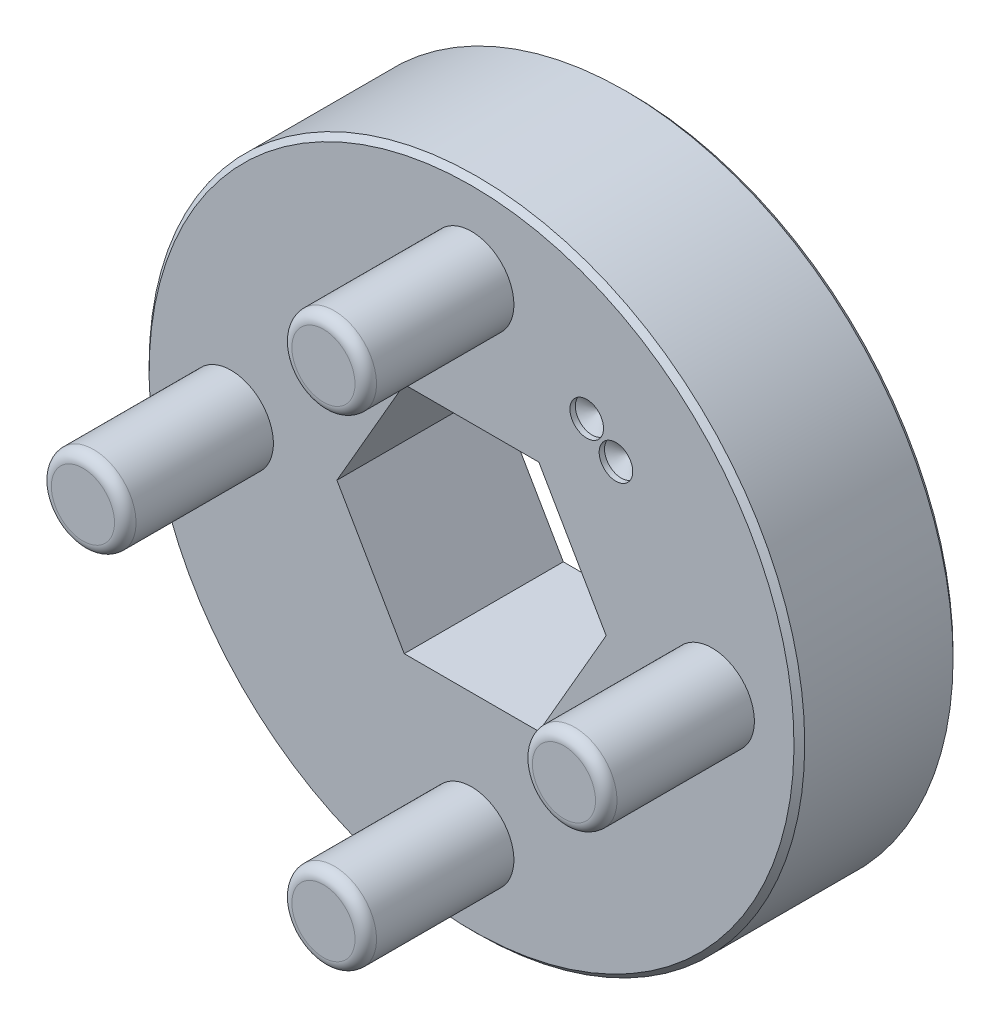
ISO-10303-21;
HEADER;
FILE_DESCRIPTION(('STEP AP214'),'2;1');
FILE_NAME('part.step','',(''),(''),'','','');
FILE_SCHEMA(('AUTOMOTIVE_DESIGN { 1 0 10303 214 1 1 1 1 }'));
ENDSEC;
DATA;
#1=APPLICATION_CONTEXT('core data for automotive mechanical design processes');
#2=APPLICATION_PROTOCOL_DEFINITION('international standard','automotive_design',2000,#1);
#3=PRODUCT_CONTEXT('',#1,'mechanical');
#4=PRODUCT('Part','Part','',(#3));
#5=PRODUCT_RELATED_PRODUCT_CATEGORY('part','',(#4));
#6=PRODUCT_DEFINITION_FORMATION('','',#4);
#7=PRODUCT_DEFINITION_CONTEXT('part definition',#1,'design');
#8=PRODUCT_DEFINITION('design','',#6,#7);
#9=PRODUCT_DEFINITION_SHAPE('','',#8);
#10=(LENGTH_UNIT() NAMED_UNIT(*) SI_UNIT(.MILLI.,.METRE.));
#11=(NAMED_UNIT(*) PLANE_ANGLE_UNIT() SI_UNIT($,.RADIAN.));
#12=(NAMED_UNIT(*) SI_UNIT($,.STERADIAN.) SOLID_ANGLE_UNIT());
#13=UNCERTAINTY_MEASURE_WITH_UNIT(LENGTH_MEASURE(1.E-05),#10,'distance_accuracy_value','');
#14=(GEOMETRIC_REPRESENTATION_CONTEXT(3) GLOBAL_UNCERTAINTY_ASSIGNED_CONTEXT((#13)) GLOBAL_UNIT_ASSIGNED_CONTEXT((#10,
#11,#12)) REPRESENTATION_CONTEXT('',''));
#15=CARTESIAN_POINT('',(0.,0.,0.));
#16=DIRECTION('',(0.,0.,1.));
#17=DIRECTION('',(1.,0.,0.));
#18=AXIS2_PLACEMENT_3D('',#15,#16,#17);
#19=CARTESIAN_POINT('',(-11.3665,1.19057767913881E-13,14.5184));
#20=DIRECTION('',(0.,0.,1.));
#21=DIRECTION('',(1.,0.,0.));
#22=AXIS2_PLACEMENT_3D('',#19,#20,#21);
#23=PLANE('',#22);
#24=CARTESIAN_POINT('',(-11.3665,1.19057767913881E-13,14.5184));
#25=DIRECTION('',(0.,0.,-1.));
#26=DIRECTION('',(-1.,0.,0.));
#27=AXIS2_PLACEMENT_3D('',#24,#25,#26);
#28=CIRCLE('',#27,1.492);
#29=CARTESIAN_POINT('',(-12.8585,1.19252927627794E-13,14.5184));
#30=VERTEX_POINT('',#29);
#31=CARTESIAN_POINT('',(-9.8745,1.19057767913881E-13,14.5184));
#32=VERTEX_POINT('',#31);
#33=EDGE_CURVE('E216',#30,#32,#28,.T.);
#34=ORIENTED_EDGE('',*,*,#33,.F.);
#35=CARTESIAN_POINT('',(-11.3665,1.19057767913881E-13,14.5184));
#36=DIRECTION('',(0.,0.,-1.));
#37=DIRECTION('',(1.,0.,0.));
#38=AXIS2_PLACEMENT_3D('',#35,#36,#37);
#39=CIRCLE('',#38,1.492);
#40=EDGE_CURVE('E213',#32,#30,#39,.T.);
#41=ORIENTED_EDGE('',*,*,#40,.F.);
#42=EDGE_LOOP('',(#34,#41));
#43=FACE_BOUND('',#42,.T.);
#44=ADVANCED_FACE('F17',(#43),#23,.T.);
#45=CARTESIAN_POINT('',(0.,-11.3665,14.5184));
#46=DIRECTION('',(0.,0.,1.));
#47=DIRECTION('',(1.,0.,0.));
#48=AXIS2_PLACEMENT_3D('',#45,#46,#47);
#49=PLANE('',#48);
#50=CARTESIAN_POINT('',(0.,-11.3665,14.5184));
#51=DIRECTION('',(0.,0.,-1.));
#52=DIRECTION('',(-1.,0.,0.));
#53=AXIS2_PLACEMENT_3D('',#50,#51,#52);
#54=CIRCLE('',#53,1.492);
#55=CARTESIAN_POINT('',(-1.492,-11.3665,14.5184));
#56=VERTEX_POINT('',#55);
#57=CARTESIAN_POINT('',(1.492,-11.3665,14.5184));
#58=VERTEX_POINT('',#57);
#59=EDGE_CURVE('E292',#56,#58,#54,.T.);
#60=ORIENTED_EDGE('',*,*,#59,.F.);
#61=CARTESIAN_POINT('',(0.,-11.3665,14.5184));
#62=DIRECTION('',(0.,0.,-1.));
#63=DIRECTION('',(1.,0.,0.));
#64=AXIS2_PLACEMENT_3D('',#61,#62,#63);
#65=CIRCLE('',#64,1.492);
#66=EDGE_CURVE('E220',#58,#56,#65,.T.);
#67=ORIENTED_EDGE('',*,*,#66,.F.);
#68=EDGE_LOOP('',(#60,#67));
#69=FACE_BOUND('',#68,.T.);
#70=ADVANCED_FACE('F294',(#69),#49,.T.);
#71=CARTESIAN_POINT('',(11.3665,0.,14.5184));
#72=DIRECTION('',(0.,0.,1.));
#73=DIRECTION('',(1.,0.,0.));
#74=AXIS2_PLACEMENT_3D('',#71,#72,#73);
#75=PLANE('',#74);
#76=CARTESIAN_POINT('',(11.3665,0.,14.5184));
#77=DIRECTION('',(0.,0.,-1.));
#78=DIRECTION('',(-1.,0.,0.));
#79=AXIS2_PLACEMENT_3D('',#76,#77,#78);
#80=CIRCLE('',#79,1.492);
#81=CARTESIAN_POINT('',(9.8745,0.,14.5184));
#82=VERTEX_POINT('',#81);
#83=CARTESIAN_POINT('',(12.8585,0.,14.5184));
#84=VERTEX_POINT('',#83);
#85=EDGE_CURVE('E288',#82,#84,#80,.T.);
#86=ORIENTED_EDGE('',*,*,#85,.F.);
#87=CARTESIAN_POINT('',(11.3665,0.,14.5184));
#88=DIRECTION('',(0.,0.,-1.));
#89=DIRECTION('',(1.,0.,0.));
#90=AXIS2_PLACEMENT_3D('',#87,#88,#89);
#91=CIRCLE('',#90,1.492);
#92=EDGE_CURVE('E279',#84,#82,#91,.T.);
#93=ORIENTED_EDGE('',*,*,#92,.F.);
#94=EDGE_LOOP('',(#86,#93));
#95=FACE_BOUND('',#94,.T.);
#96=ADVANCED_FACE('F137',(#95),#75,.T.);
#97=CARTESIAN_POINT('',(0.,11.3665,14.5184));
#98=DIRECTION('',(0.,0.,1.));
#99=DIRECTION('',(1.,0.,0.));
#100=AXIS2_PLACEMENT_3D('',#97,#98,#99);
#101=PLANE('',#100);
#102=CARTESIAN_POINT('',(0.,11.3665,14.5184));
#103=DIRECTION('',(0.,0.,-1.));
#104=DIRECTION('',(-1.,0.,0.));
#105=AXIS2_PLACEMENT_3D('',#102,#103,#104);
#106=CIRCLE('',#105,1.492);
#107=CARTESIAN_POINT('',(-1.492,11.3665,14.5184));
#108=VERTEX_POINT('',#107);
#109=CARTESIAN_POINT('',(1.492,11.3665,14.5184));
#110=VERTEX_POINT('',#109);
#111=EDGE_CURVE('E112',#108,#110,#106,.T.);
#112=ORIENTED_EDGE('',*,*,#111,.F.);
#113=CARTESIAN_POINT('',(0.,11.3665,14.5184));
#114=DIRECTION('',(0.,0.,-1.));
#115=DIRECTION('',(1.,0.,0.));
#116=AXIS2_PLACEMENT_3D('',#113,#114,#115);
#117=CIRCLE('',#116,1.492);
#118=EDGE_CURVE('E117',#110,#108,#117,.T.);
#119=ORIENTED_EDGE('',*,*,#118,.F.);
#120=EDGE_LOOP('',(#112,#119));
#121=FACE_BOUND('',#120,.T.);
#122=ADVANCED_FACE('F105',(#121),#101,.T.);
#123=CARTESIAN_POINT('',(5.44497650823394,8.41824079302751,7.26439999999684));
#124=DIRECTION('',(0.,0.,1.));
#125=DIRECTION('',(0.,-1.,0.));
#126=AXIS2_PLACEMENT_3D('',#123,#124,#125);
#127=CONICAL_SURFACE('',#126,0.793749999995381,1.02974425861255);
#128=CARTESIAN_POINT('',(5.44497650830067,8.41824079302751,6.78746688365095));
#129=VERTEX_POINT('',#128);
#130=VERTEX_LOOP('',#129);
#131=FACE_BOUND('',#130,.T.);
#132=CARTESIAN_POINT('',(5.44497650823394,8.41824079302751,7.2644));
#133=DIRECTION('',(0.,0.,1.));
#134=DIRECTION('',(1.,0.,0.));
#135=AXIS2_PLACEMENT_3D('',#132,#133,#134);
#136=CIRCLE('',#135,0.793749999999994);
#137=CARTESIAN_POINT('',(6.23872650823393,8.41824079302751,7.2644));
#138=VERTEX_POINT('',#137);
#139=EDGE_CURVE('E109',#138,#138,#136,.T.);
#140=ORIENTED_EDGE('',*,*,#139,.T.);
#141=EDGE_LOOP('',(#140));
#142=FACE_BOUND('',#141,.T.);
#143=ADVANCED_FACE('F101',(#131,#142),#127,.F.);
#144=CARTESIAN_POINT('',(6.82406725314877,7.34483855160306,7.26440000011053));
#145=DIRECTION('',(0.,0.,1.));
#146=DIRECTION('',(1.,0.,0.));
#147=AXIS2_PLACEMENT_3D('',#144,#145,#146);
#148=CONICAL_SURFACE('',#147,0.793750000127602,1.0297442586964);
#149=CARTESIAN_POINT('',(6.82406725314877,7.34483855160306,6.78746688373622));
#150=VERTEX_POINT('',#149);
#151=VERTEX_LOOP('',#150);
#152=FACE_BOUND('',#151,.T.);
#153=CARTESIAN_POINT('',(6.82406725314877,7.34483855160306,7.2644));
#154=DIRECTION('',(0.,0.,1.));
#155=DIRECTION('',(1.,0.,0.));
#156=AXIS2_PLACEMENT_3D('',#153,#154,#155);
#157=CIRCLE('',#156,0.793749999999994);
#158=CARTESIAN_POINT('',(7.61781725314876,7.34483855160306,7.2644));
#159=VERTEX_POINT('',#158);
#160=EDGE_CURVE('E111',#159,#159,#157,.T.);
#161=ORIENTED_EDGE('',*,*,#160,.T.);
#162=EDGE_LOOP('',(#161));
#163=FACE_BOUND('',#162,.T.);
#164=ADVANCED_FACE('F104',(#152,#163),#148,.F.);
#165=CARTESIAN_POINT('',(-11.3665,1.19057767913881E-13,14.0104));
#166=DIRECTION('',(0.,0.,1.));
#167=DIRECTION('',(1.,0.,0.));
#168=AXIS2_PLACEMENT_3D('',#165,#166,#167);
#169=TOROIDAL_SURFACE('',#168,1.492,0.508);
#170=ORIENTED_EDGE('',*,*,#40,.T.);
#171=ORIENTED_EDGE('',*,*,#33,.T.);
#172=EDGE_LOOP('',(#170,#171));
#173=FACE_BOUND('',#172,.T.);
#174=CARTESIAN_POINT('',(-11.3665,1.19057767913881E-13,14.0104));
#175=DIRECTION('',(0.,0.,-1.));
#176=DIRECTION('',(-1.,0.,0.));
#177=AXIS2_PLACEMENT_3D('',#174,#175,#176);
#178=CIRCLE('',#177,2.);
#179=CARTESIAN_POINT('',(-13.3665,1.19057767913881E-13,14.0104));
#180=VERTEX_POINT('',#179);
#181=EDGE_CURVE('E115',#180,#180,#178,.T.);
#182=ORIENTED_EDGE('',*,*,#181,.F.);
#183=EDGE_LOOP('',(#182));
#184=FACE_BOUND('',#183,.T.);
#185=ADVANCED_FACE('F192',(#173,#184),#169,.T.);
#186=CARTESIAN_POINT('',(0.,-11.3665,14.0104));
#187=DIRECTION('',(0.,0.,1.));
#188=DIRECTION('',(1.,0.,0.));
#189=AXIS2_PLACEMENT_3D('',#186,#187,#188);
#190=TOROIDAL_SURFACE('',#189,1.492,0.508);
#191=ORIENTED_EDGE('',*,*,#66,.T.);
#192=ORIENTED_EDGE('',*,*,#59,.T.);
#193=EDGE_LOOP('',(#191,#192));
#194=FACE_BOUND('',#193,.T.);
#195=CARTESIAN_POINT('',(0.,-11.3665,14.0104));
#196=DIRECTION('',(0.,0.,-1.));
#197=DIRECTION('',(-1.,0.,0.));
#198=AXIS2_PLACEMENT_3D('',#195,#196,#197);
#199=CIRCLE('',#198,2.);
#200=CARTESIAN_POINT('',(-2.,-11.3665,14.0104));
#201=VERTEX_POINT('',#200);
#202=EDGE_CURVE('E182',#201,#201,#199,.T.);
#203=ORIENTED_EDGE('',*,*,#202,.F.);
#204=EDGE_LOOP('',(#203));
#205=FACE_BOUND('',#204,.T.);
#206=ADVANCED_FACE('F189',(#194,#205),#190,.T.);
#207=CARTESIAN_POINT('',(11.3665,0.,14.0104));
#208=DIRECTION('',(0.,0.,1.));
#209=DIRECTION('',(1.,0.,0.));
#210=AXIS2_PLACEMENT_3D('',#207,#208,#209);
#211=TOROIDAL_SURFACE('',#210,1.492,0.508);
#212=ORIENTED_EDGE('',*,*,#92,.T.);
#213=ORIENTED_EDGE('',*,*,#85,.T.);
#214=EDGE_LOOP('',(#212,#213));
#215=FACE_BOUND('',#214,.T.);
#216=CARTESIAN_POINT('',(11.3665,0.,14.0104));
#217=DIRECTION('',(0.,0.,-1.));
#218=DIRECTION('',(-1.,0.,0.));
#219=AXIS2_PLACEMENT_3D('',#216,#217,#218);
#220=CIRCLE('',#219,2.);
#221=CARTESIAN_POINT('',(9.3665,0.,14.0104));
#222=VERTEX_POINT('',#221);
#223=EDGE_CURVE('E180',#222,#222,#220,.T.);
#224=ORIENTED_EDGE('',*,*,#223,.F.);
#225=EDGE_LOOP('',(#224));
#226=FACE_BOUND('',#225,.T.);
#227=ADVANCED_FACE('F169',(#215,#226),#211,.T.);
#228=CARTESIAN_POINT('',(0.,11.3665,14.0104));
#229=DIRECTION('',(0.,0.,1.));
#230=DIRECTION('',(1.,0.,0.));
#231=AXIS2_PLACEMENT_3D('',#228,#229,#230);
#232=TOROIDAL_SURFACE('',#231,1.492,0.508);
#233=ORIENTED_EDGE('',*,*,#118,.T.);
#234=ORIENTED_EDGE('',*,*,#111,.T.);
#235=EDGE_LOOP('',(#233,#234));
#236=FACE_BOUND('',#235,.T.);
#237=CARTESIAN_POINT('',(0.,11.3665,14.0104));
#238=DIRECTION('',(0.,0.,-1.));
#239=DIRECTION('',(-1.,0.,0.));
#240=AXIS2_PLACEMENT_3D('',#237,#238,#239);
#241=CIRCLE('',#240,2.);
#242=CARTESIAN_POINT('',(-2.,11.3665,14.0104));
#243=VERTEX_POINT('',#242);
#244=EDGE_CURVE('E178',#243,#243,#241,.T.);
#245=ORIENTED_EDGE('',*,*,#244,.F.);
#246=EDGE_LOOP('',(#245));
#247=FACE_BOUND('',#246,.T.);
#248=ADVANCED_FACE('F157',(#236,#247),#232,.T.);
#249=CARTESIAN_POINT('',(5.44497650823394,8.41824079302751,7.5184));
#250=DIRECTION('',(0.,0.,1.));
#251=DIRECTION('',(1.,0.,0.));
#252=AXIS2_PLACEMENT_3D('',#249,#250,#251);
#253=CYLINDRICAL_SURFACE('',#252,0.793749999999994);
#254=CARTESIAN_POINT('',(5.44497650823394,8.41824079302751,7.5184));
#255=DIRECTION('',(0.,0.,1.));
#256=DIRECTION('',(1.,0.,0.));
#257=AXIS2_PLACEMENT_3D('',#254,#255,#256);
#258=CIRCLE('',#257,0.793749999999994);
#259=CARTESIAN_POINT('',(6.23872650823393,8.41824079302751,7.5184));
#260=VERTEX_POINT('',#259);
#261=EDGE_CURVE('E265',#260,#260,#258,.F.);
#262=ORIENTED_EDGE('',*,*,#261,.F.);
#263=EDGE_LOOP('',(#262));
#264=FACE_BOUND('',#263,.T.);
#265=ORIENTED_EDGE('',*,*,#139,.F.);
#266=EDGE_LOOP('',(#265));
#267=FACE_BOUND('',#266,.T.);
#268=ADVANCED_FACE('F168',(#264,#267),#253,.F.);
#269=CARTESIAN_POINT('',(6.82406725314877,7.34483855160306,7.5184));
#270=DIRECTION('',(0.,0.,1.));
#271=DIRECTION('',(1.,0.,0.));
#272=AXIS2_PLACEMENT_3D('',#269,#270,#271);
#273=CYLINDRICAL_SURFACE('',#272,0.793749999999994);
#274=CARTESIAN_POINT('',(6.82406725314877,7.34483855160306,7.5184));
#275=DIRECTION('',(0.,0.,1.));
#276=DIRECTION('',(1.,0.,0.));
#277=AXIS2_PLACEMENT_3D('',#274,#275,#276);
#278=CIRCLE('',#277,0.793749999999994);
#279=CARTESIAN_POINT('',(7.61781725314876,7.34483855160306,7.5184));
#280=VERTEX_POINT('',#279);
#281=EDGE_CURVE('E262',#280,#280,#278,.F.);
#282=ORIENTED_EDGE('',*,*,#281,.F.);
#283=EDGE_LOOP('',(#282));
#284=FACE_BOUND('',#283,.T.);
#285=ORIENTED_EDGE('',*,*,#160,.F.);
#286=EDGE_LOOP('',(#285));
#287=FACE_BOUND('',#286,.T.);
#288=ADVANCED_FACE('F362',(#284,#287),#273,.F.);
#289=CARTESIAN_POINT('',(-11.3665,1.19057767913881E-13,14.5184));
#290=DIRECTION('',(0.,0.,-1.));
#291=DIRECTION('',(-1.,0.,0.));
#292=AXIS2_PLACEMENT_3D('',#289,#290,#291);
#293=CYLINDRICAL_SURFACE('',#292,2.);
#294=CARTESIAN_POINT('',(-11.3665,1.19057767913881E-13,7.5184));
#295=DIRECTION('',(0.,0.,-1.));
#296=DIRECTION('',(-1.,0.,0.));
#297=AXIS2_PLACEMENT_3D('',#294,#295,#296);
#298=CIRCLE('',#297,2.);
#299=CARTESIAN_POINT('',(-13.3665,1.19057767913881E-13,7.5184));
#300=VERTEX_POINT('',#299);
#301=EDGE_CURVE('E259',#300,#300,#298,.T.);
#302=ORIENTED_EDGE('',*,*,#301,.F.);
#303=EDGE_LOOP('',(#302));
#304=FACE_BOUND('',#303,.T.);
#305=ORIENTED_EDGE('',*,*,#181,.T.);
#306=EDGE_LOOP('',(#305));
#307=FACE_BOUND('',#306,.T.);
#308=ADVANCED_FACE('F359',(#304,#307),#293,.T.);
#309=CARTESIAN_POINT('',(0.,-11.3665,14.5184));
#310=DIRECTION('',(0.,0.,-1.));
#311=DIRECTION('',(-1.,0.,0.));
#312=AXIS2_PLACEMENT_3D('',#309,#310,#311);
#313=CYLINDRICAL_SURFACE('',#312,2.);
#314=CARTESIAN_POINT('',(0.,-11.3665,7.5184));
#315=DIRECTION('',(0.,0.,-1.));
#316=DIRECTION('',(-1.,0.,0.));
#317=AXIS2_PLACEMENT_3D('',#314,#315,#316);
#318=CIRCLE('',#317,2.);
#319=CARTESIAN_POINT('',(-2.,-11.3665,7.5184));
#320=VERTEX_POINT('',#319);
#321=EDGE_CURVE('E256',#320,#320,#318,.T.);
#322=ORIENTED_EDGE('',*,*,#321,.F.);
#323=EDGE_LOOP('',(#322));
#324=FACE_BOUND('',#323,.T.);
#325=ORIENTED_EDGE('',*,*,#202,.T.);
#326=EDGE_LOOP('',(#325));
#327=FACE_BOUND('',#326,.T.);
#328=ADVANCED_FACE('F355',(#324,#327),#313,.T.);
#329=CARTESIAN_POINT('',(11.3665,0.,14.5184));
#330=DIRECTION('',(0.,0.,-1.));
#331=DIRECTION('',(-1.,0.,0.));
#332=AXIS2_PLACEMENT_3D('',#329,#330,#331);
#333=CYLINDRICAL_SURFACE('',#332,2.);
#334=CARTESIAN_POINT('',(11.3665,0.,7.5184));
#335=DIRECTION('',(0.,0.,-1.));
#336=DIRECTION('',(-1.,0.,0.));
#337=AXIS2_PLACEMENT_3D('',#334,#335,#336);
#338=CIRCLE('',#337,2.);
#339=CARTESIAN_POINT('',(9.3665,0.,7.5184));
#340=VERTEX_POINT('',#339);
#341=EDGE_CURVE('E253',#340,#340,#338,.T.);
#342=ORIENTED_EDGE('',*,*,#341,.F.);
#343=EDGE_LOOP('',(#342));
#344=FACE_BOUND('',#343,.T.);
#345=ORIENTED_EDGE('',*,*,#223,.T.);
#346=EDGE_LOOP('',(#345));
#347=FACE_BOUND('',#346,.T.);
#348=ADVANCED_FACE('F351',(#344,#347),#333,.T.);
#349=CARTESIAN_POINT('',(0.,11.3665,14.5184));
#350=DIRECTION('',(0.,0.,-1.));
#351=DIRECTION('',(-1.,0.,0.));
#352=AXIS2_PLACEMENT_3D('',#349,#350,#351);
#353=CYLINDRICAL_SURFACE('',#352,2.);
#354=CARTESIAN_POINT('',(0.,11.3665,7.5184));
#355=DIRECTION('',(0.,0.,-1.));
#356=DIRECTION('',(-1.,0.,0.));
#357=AXIS2_PLACEMENT_3D('',#354,#355,#356);
#358=CIRCLE('',#357,2.);
#359=CARTESIAN_POINT('',(-2.,11.3665,7.5184));
#360=VERTEX_POINT('',#359);
#361=EDGE_CURVE('E250',#360,#360,#358,.T.);
#362=ORIENTED_EDGE('',*,*,#361,.F.);
#363=EDGE_LOOP('',(#362));
#364=FACE_BOUND('',#363,.T.);
#365=ORIENTED_EDGE('',*,*,#244,.T.);
#366=EDGE_LOOP('',(#365));
#367=FACE_BOUND('',#366,.T.);
#368=ADVANCED_FACE('F347',(#364,#367),#353,.T.);
#369=CARTESIAN_POINT('',(0.,0.,7.26440000000001));
#370=DIRECTION('',(0.,0.,-1.));
#371=DIRECTION('',(0.,1.,0.));
#372=AXIS2_PLACEMENT_3D('',#369,#370,#371);
#373=CONICAL_SURFACE('',#372,15.494,0.785398163397442);
#374=CARTESIAN_POINT('',(0.,0.,7.5184));
#375=DIRECTION('',(0.,0.,-1.));
#376=DIRECTION('',(0.,1.,0.));
#377=AXIS2_PLACEMENT_3D('',#374,#375,#376);
#378=CIRCLE('',#377,15.24);
#379=CARTESIAN_POINT('',(0.,15.24,7.5184));
#380=VERTEX_POINT('',#379);
#381=EDGE_CURVE('E246',#380,#380,#378,.F.);
#382=ORIENTED_EDGE('',*,*,#381,.F.);
#383=EDGE_LOOP('',(#382));
#384=FACE_BOUND('',#383,.T.);
#385=CARTESIAN_POINT('',(0.,0.,7.26440000000001));
#386=DIRECTION('',(0.,0.,-1.));
#387=DIRECTION('',(-1.,0.,0.));
#388=AXIS2_PLACEMENT_3D('',#385,#386,#387);
#389=CIRCLE('',#388,15.494);
#390=CARTESIAN_POINT('',(-15.494,0.,7.26440000000001));
#391=VERTEX_POINT('',#390);
#392=EDGE_CURVE('E249',#391,#391,#389,.T.);
#393=ORIENTED_EDGE('',*,*,#392,.F.);
#394=EDGE_LOOP('',(#393));
#395=FACE_BOUND('',#394,.T.);
#396=ADVANCED_FACE('F343',(#384,#395),#373,.T.);
#397=CARTESIAN_POINT('',(0.,0.,7.5184));
#398=DIRECTION('',(0.,0.,1.));
#399=DIRECTION('',(1.,0.,0.));
#400=AXIS2_PLACEMENT_3D('',#397,#398,#399);
#401=PLANE('',#400);
#402=ORIENTED_EDGE('',*,*,#381,.T.);
#403=EDGE_LOOP('',(#402));
#404=FACE_BOUND('',#403,.T.);
#405=DIRECTION('',(1.,0.,0.));
#406=VECTOR('',#405,1.);
#407=CARTESIAN_POINT('',(3.18135,5.51025983665925,7.5184));
#408=LINE('',#407,#406);
#409=CARTESIAN_POINT('',(-3.18135,5.51025983665925,7.5184));
#410=VERTEX_POINT('',#409);
#411=CARTESIAN_POINT('',(3.18135,5.51025983665925,7.5184));
#412=VERTEX_POINT('',#411);
#413=EDGE_CURVE('E584',#410,#412,#408,.T.);
#414=ORIENTED_EDGE('',*,*,#413,.T.);
#415=DIRECTION('',(-0.5,0.866025403784439,0.));
#416=VECTOR('',#415,1.);
#417=CARTESIAN_POINT('',(6.3627,0.,7.5184));
#418=LINE('',#417,#416);
#419=CARTESIAN_POINT('',(6.3627,0.,7.5184));
#420=VERTEX_POINT('',#419);
#421=EDGE_CURVE('E589',#412,#420,#418,.F.);
#422=ORIENTED_EDGE('',*,*,#421,.T.);
#423=DIRECTION('',(0.5,0.866025403784439,0.));
#424=VECTOR('',#423,1.);
#425=CARTESIAN_POINT('',(3.18135,-5.51025983665925,7.5184));
#426=LINE('',#425,#424);
#427=CARTESIAN_POINT('',(3.18135,-5.51025983665925,7.5184));
#428=VERTEX_POINT('',#427);
#429=EDGE_CURVE('E594',#420,#428,#426,.F.);
#430=ORIENTED_EDGE('',*,*,#429,.T.);
#431=DIRECTION('',(1.,0.,0.));
#432=VECTOR('',#431,1.);
#433=CARTESIAN_POINT('',(-3.18135,-5.51025983665925,7.5184));
#434=LINE('',#433,#432);
#435=CARTESIAN_POINT('',(-3.18135,-5.51025983665925,7.5184));
#436=VERTEX_POINT('',#435);
#437=EDGE_CURVE('E575',#428,#436,#434,.F.);
#438=ORIENTED_EDGE('',*,*,#437,.T.);
#439=DIRECTION('',(0.5,-0.866025403784439,0.));
#440=VECTOR('',#439,1.);
#441=CARTESIAN_POINT('',(-6.3627,0.,7.5184));
#442=LINE('',#441,#440);
#443=CARTESIAN_POINT('',(-6.3627,0.,7.5184));
#444=VERTEX_POINT('',#443);
#445=EDGE_CURVE('E568',#436,#444,#442,.F.);
#446=ORIENTED_EDGE('',*,*,#445,.T.);
#447=DIRECTION('',(-0.5,-0.866025403784439,0.));
#448=VECTOR('',#447,1.);
#449=CARTESIAN_POINT('',(-3.18135,5.51025983665925,7.5184));
#450=LINE('',#449,#448);
#451=EDGE_CURVE('E579',#444,#410,#450,.F.);
#452=ORIENTED_EDGE('',*,*,#451,.T.);
#453=EDGE_LOOP('',(#414,#422,#430,#438,#446,#452));
#454=FACE_BOUND('',#453,.T.);
#455=ORIENTED_EDGE('',*,*,#361,.T.);
#456=EDGE_LOOP('',(#455));
#457=FACE_BOUND('',#456,.T.);
#458=ORIENTED_EDGE('',*,*,#341,.T.);
#459=EDGE_LOOP('',(#458));
#460=FACE_BOUND('',#459,.T.);
#461=ORIENTED_EDGE('',*,*,#321,.T.);
#462=EDGE_LOOP('',(#461));
#463=FACE_BOUND('',#462,.T.);
#464=ORIENTED_EDGE('',*,*,#301,.T.);
#465=EDGE_LOOP('',(#464));
#466=FACE_BOUND('',#465,.T.);
#467=ORIENTED_EDGE('',*,*,#281,.T.);
#468=EDGE_LOOP('',(#467));
#469=FACE_BOUND('',#468,.T.);
#470=ORIENTED_EDGE('',*,*,#261,.T.);
#471=EDGE_LOOP('',(#470));
#472=FACE_BOUND('',#471,.T.);
#473=ADVANCED_FACE('F339',(#404,#454,#457,#460,#463,#466,#469,#472),#401,.T.);
#474=CARTESIAN_POINT('',(0.,0.,7.5184));
#475=DIRECTION('',(0.,0.,-1.));
#476=DIRECTION('',(-1.,0.,0.));
#477=AXIS2_PLACEMENT_3D('',#474,#475,#476);
#478=CYLINDRICAL_SURFACE('',#477,15.494);
#479=ORIENTED_EDGE('',*,*,#392,.T.);
#480=EDGE_LOOP('',(#479));
#481=FACE_BOUND('',#480,.T.);
#482=CARTESIAN_POINT('',(0.,0.,0.254000000000004));
#483=DIRECTION('',(0.,0.,1.));
#484=DIRECTION('',(1.,0.,0.));
#485=AXIS2_PLACEMENT_3D('',#482,#483,#484);
#486=CIRCLE('',#485,15.494);
#487=CARTESIAN_POINT('',(15.494,0.,0.254000000000004));
#488=VERTEX_POINT('',#487);
#489=EDGE_CURVE('E572',#488,#488,#486,.F.);
#490=ORIENTED_EDGE('',*,*,#489,.F.);
#491=EDGE_LOOP('',(#490));
#492=FACE_BOUND('',#491,.T.);
#493=ADVANCED_FACE('F335',(#481,#492),#478,.T.);
#494=CARTESIAN_POINT('',(-6.3627,0.,0.));
#495=DIRECTION('',(-0.866025403784439,-0.5,0.));
#496=DIRECTION('',(0.5,-0.866025403784439,0.));
#497=AXIS2_PLACEMENT_3D('',#494,#495,#496);
#498=PLANE('',#497);
#499=DIRECTION('',(0.,0.,-1.));
#500=VECTOR('',#499,1.);
#501=CARTESIAN_POINT('',(-3.18135,-5.51025983665925,0.));
#502=LINE('',#501,#500);
#503=CARTESIAN_POINT('',(-3.18135,-5.51025983665925,0.));
#504=VERTEX_POINT('',#503);
#505=EDGE_CURVE('E596',#436,#504,#502,.T.);
#506=ORIENTED_EDGE('',*,*,#505,.T.);
#507=DIRECTION('',(-0.5,0.866025403784439,0.));
#508=VECTOR('',#507,1.);
#509=CARTESIAN_POINT('',(-3.18135,-5.51025983665925,0.));
#510=LINE('',#509,#508);
#511=CARTESIAN_POINT('',(-6.3627,0.,0.));
#512=VERTEX_POINT('',#511);
#513=EDGE_CURVE('E574',#504,#512,#510,.T.);
#514=ORIENTED_EDGE('',*,*,#513,.T.);
#515=DIRECTION('',(0.,0.,1.));
#516=VECTOR('',#515,1.);
#517=CARTESIAN_POINT('',(-6.3627,0.,0.));
#518=LINE('',#517,#516);
#519=EDGE_CURVE('E569',#512,#444,#518,.T.);
#520=ORIENTED_EDGE('',*,*,#519,.T.);
#521=ORIENTED_EDGE('',*,*,#445,.F.);
#522=EDGE_LOOP('',(#506,#514,#520,#521));
#523=FACE_BOUND('',#522,.T.);
#524=ADVANCED_FACE('F331',(#523),#498,.F.);
#525=CARTESIAN_POINT('',(-3.18135,5.51025983665925,0.));
#526=DIRECTION('',(-0.866025403784439,0.5,0.));
#527=DIRECTION('',(-0.5,-0.866025403784439,0.));
#528=AXIS2_PLACEMENT_3D('',#525,#526,#527);
#529=PLANE('',#528);
#530=ORIENTED_EDGE('',*,*,#519,.F.);
#531=DIRECTION('',(0.5,0.866025403784439,0.));
#532=VECTOR('',#531,1.);
#533=CARTESIAN_POINT('',(-6.3627,0.,0.));
#534=LINE('',#533,#532);
#535=CARTESIAN_POINT('',(-3.18135,5.51025983665925,0.));
#536=VERTEX_POINT('',#535);
#537=EDGE_CURVE('E604',#512,#536,#534,.T.);
#538=ORIENTED_EDGE('',*,*,#537,.T.);
#539=DIRECTION('',(0.,0.,1.));
#540=VECTOR('',#539,1.);
#541=CARTESIAN_POINT('',(-3.18135,5.51025983665925,0.));
#542=LINE('',#541,#540);
#543=EDGE_CURVE('E581',#536,#410,#542,.T.);
#544=ORIENTED_EDGE('',*,*,#543,.T.);
#545=ORIENTED_EDGE('',*,*,#451,.F.);
#546=EDGE_LOOP('',(#530,#538,#544,#545));
#547=FACE_BOUND('',#546,.T.);
#548=ADVANCED_FACE('F327',(#547),#529,.F.);
#549=CARTESIAN_POINT('',(3.18135,5.51025983665925,0.));
#550=DIRECTION('',(0.,1.,0.));
#551=DIRECTION('',(0.,0.,1.));
#552=AXIS2_PLACEMENT_3D('',#549,#550,#551);
#553=PLANE('',#552);
#554=ORIENTED_EDGE('',*,*,#543,.F.);
#555=DIRECTION('',(1.,0.,0.));
#556=VECTOR('',#555,1.);
#557=CARTESIAN_POINT('',(0.,5.51025983665925,0.));
#558=LINE('',#557,#556);
#559=CARTESIAN_POINT('',(3.18135,5.51025983665925,0.));
#560=VERTEX_POINT('',#559);
#561=EDGE_CURVE('E607',#536,#560,#558,.T.);
#562=ORIENTED_EDGE('',*,*,#561,.T.);
#563=DIRECTION('',(0.,0.,1.));
#564=VECTOR('',#563,1.);
#565=CARTESIAN_POINT('',(3.18135,5.51025983665925,0.));
#566=LINE('',#565,#564);
#567=EDGE_CURVE('E586',#560,#412,#566,.T.);
#568=ORIENTED_EDGE('',*,*,#567,.T.);
#569=ORIENTED_EDGE('',*,*,#413,.F.);
#570=EDGE_LOOP('',(#554,#562,#568,#569));
#571=FACE_BOUND('',#570,.T.);
#572=ADVANCED_FACE('F323',(#571),#553,.F.);
#573=CARTESIAN_POINT('',(6.3627,0.,0.));
#574=DIRECTION('',(0.866025403784439,0.5,0.));
#575=DIRECTION('',(-0.5,0.866025403784439,0.));
#576=AXIS2_PLACEMENT_3D('',#573,#574,#575);
#577=PLANE('',#576);
#578=ORIENTED_EDGE('',*,*,#567,.F.);
#579=DIRECTION('',(0.5,-0.866025403784439,0.));
#580=VECTOR('',#579,1.);
#581=CARTESIAN_POINT('',(3.18135,5.51025983665925,0.));
#582=LINE('',#581,#580);
#583=CARTESIAN_POINT('',(6.3627,0.,0.));
#584=VERTEX_POINT('',#583);
#585=EDGE_CURVE('E610',#560,#584,#582,.T.);
#586=ORIENTED_EDGE('',*,*,#585,.T.);
#587=DIRECTION('',(0.,0.,1.));
#588=VECTOR('',#587,1.);
#589=CARTESIAN_POINT('',(6.3627,0.,0.));
#590=LINE('',#589,#588);
#591=EDGE_CURVE('E591',#584,#420,#590,.T.);
#592=ORIENTED_EDGE('',*,*,#591,.T.);
#593=ORIENTED_EDGE('',*,*,#421,.F.);
#594=EDGE_LOOP('',(#578,#586,#592,#593));
#595=FACE_BOUND('',#594,.T.);
#596=ADVANCED_FACE('F319',(#595),#577,.F.);
#597=CARTESIAN_POINT('',(3.18135,-5.51025983665925,0.));
#598=DIRECTION('',(0.866025403784439,-0.5,0.));
#599=DIRECTION('',(0.5,0.866025403784439,0.));
#600=AXIS2_PLACEMENT_3D('',#597,#598,#599);
#601=PLANE('',#600);
#602=ORIENTED_EDGE('',*,*,#591,.F.);
#603=DIRECTION('',(-0.5,-0.866025403784439,0.));
#604=VECTOR('',#603,1.);
#605=CARTESIAN_POINT('',(6.3627,0.,0.));
#606=LINE('',#605,#604);
#607=CARTESIAN_POINT('',(3.18135,-5.51025983665925,0.));
#608=VERTEX_POINT('',#607);
#609=EDGE_CURVE('E613',#584,#608,#606,.T.);
#610=ORIENTED_EDGE('',*,*,#609,.T.);
#611=DIRECTION('',(0.,0.,-1.));
#612=VECTOR('',#611,1.);
#613=CARTESIAN_POINT('',(3.18135,-5.51025983665925,0.));
#614=LINE('',#613,#612);
#615=EDGE_CURVE('E38',#608,#428,#614,.F.);
#616=ORIENTED_EDGE('',*,*,#615,.T.);
#617=ORIENTED_EDGE('',*,*,#429,.F.);
#618=EDGE_LOOP('',(#602,#610,#616,#617));
#619=FACE_BOUND('',#618,.T.);
#620=ADVANCED_FACE('F316',(#619),#601,.F.);
#621=CARTESIAN_POINT('',(-3.18135,-5.51025983665925,0.));
#622=DIRECTION('',(0.,-1.,0.));
#623=DIRECTION('',(0.,0.,-1.));
#624=AXIS2_PLACEMENT_3D('',#621,#622,#623);
#625=PLANE('',#624);
#626=ORIENTED_EDGE('',*,*,#615,.F.);
#627=DIRECTION('',(1.,0.,0.));
#628=VECTOR('',#627,1.);
#629=CARTESIAN_POINT('',(0.,-5.51025983665925,0.));
#630=LINE('',#629,#628);
#631=EDGE_CURVE('E29',#608,#504,#630,.F.);
#632=ORIENTED_EDGE('',*,*,#631,.T.);
#633=ORIENTED_EDGE('',*,*,#505,.F.);
#634=ORIENTED_EDGE('',*,*,#437,.F.);
#635=EDGE_LOOP('',(#626,#632,#633,#634));
#636=FACE_BOUND('',#635,.T.);
#637=ADVANCED_FACE('F308',(#636),#625,.F.);
#638=CARTESIAN_POINT('',(0.,0.,0.254000000000004));
#639=DIRECTION('',(0.,0.,1.));
#640=DIRECTION('',(1.,0.,0.));
#641=AXIS2_PLACEMENT_3D('',#638,#639,#640);
#642=CONICAL_SURFACE('',#641,15.494,0.785398163397458);
#643=CARTESIAN_POINT('',(0.,0.,0.));
#644=DIRECTION('',(0.,0.,1.));
#645=DIRECTION('',(1.,0.,0.));
#646=AXIS2_PLACEMENT_3D('',#643,#644,#645);
#647=CIRCLE('',#646,15.24);
#648=CARTESIAN_POINT('',(15.24,0.,0.));
#649=VERTEX_POINT('',#648);
#650=EDGE_CURVE('E11',#649,#649,#647,.T.);
#651=ORIENTED_EDGE('',*,*,#650,.T.);
#652=EDGE_LOOP('',(#651));
#653=FACE_BOUND('',#652,.T.);
#654=ORIENTED_EDGE('',*,*,#489,.T.);
#655=EDGE_LOOP('',(#654));
#656=FACE_BOUND('',#655,.T.);
#657=ADVANCED_FACE('F302',(#653,#656),#642,.T.);
#658=CARTESIAN_POINT('',(0.,0.,0.));
#659=DIRECTION('',(0.,0.,1.));
#660=DIRECTION('',(1.,0.,0.));
#661=AXIS2_PLACEMENT_3D('',#658,#659,#660);
#662=PLANE('',#661);
#663=ORIENTED_EDGE('',*,*,#650,.F.);
#664=EDGE_LOOP('',(#663));
#665=FACE_BOUND('',#664,.T.);
#666=ORIENTED_EDGE('',*,*,#609,.F.);
#667=ORIENTED_EDGE('',*,*,#585,.F.);
#668=ORIENTED_EDGE('',*,*,#561,.F.);
#669=ORIENTED_EDGE('',*,*,#537,.F.);
#670=ORIENTED_EDGE('',*,*,#513,.F.);
#671=ORIENTED_EDGE('',*,*,#631,.F.);
#672=EDGE_LOOP('',(#666,#667,#668,#669,#670,#671));
#673=FACE_BOUND('',#672,.T.);
#674=ADVANCED_FACE('F300',(#665,#673),#662,.F.);
#675=CLOSED_SHELL('',(#44,#70,#96,#122,#143,#164,#185,#206,#227,#248,#268,#288,#308,#328,#348,
#368,#396,#473,#493,#524,#548,#572,#596,#620,#637,#657,#674));
#676=MANIFOLD_SOLID_BREP('B1',#675);
#677=ADVANCED_BREP_SHAPE_REPRESENTATION('',(#18,#676),#14);
#678=SHAPE_DEFINITION_REPRESENTATION(#9,#677);
ENDSEC;
END-ISO-10303-21;
